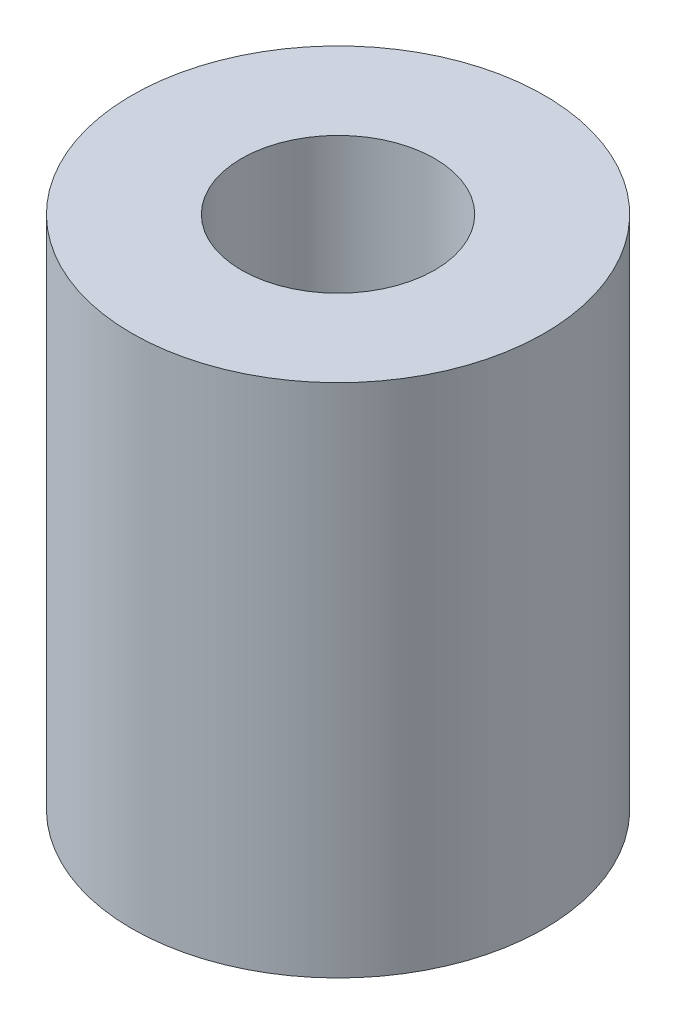
ISO-10303-21;
HEADER;
FILE_DESCRIPTION(('STEP AP214'),'2;1');
FILE_NAME('part.step','',(''),(''),'','','');
FILE_SCHEMA(('AUTOMOTIVE_DESIGN { 1 0 10303 214 1 1 1 1 }'));
ENDSEC;
DATA;
#1=APPLICATION_CONTEXT('core data for automotive mechanical design processes');
#2=APPLICATION_PROTOCOL_DEFINITION('international standard','automotive_design',2000,#1);
#3=PRODUCT_CONTEXT('',#1,'mechanical');
#4=PRODUCT('Part','Part','',(#3));
#5=PRODUCT_RELATED_PRODUCT_CATEGORY('part','',(#4));
#6=PRODUCT_DEFINITION_FORMATION('','',#4);
#7=PRODUCT_DEFINITION_CONTEXT('part definition',#1,'design');
#8=PRODUCT_DEFINITION('design','',#6,#7);
#9=PRODUCT_DEFINITION_SHAPE('','',#8);
#10=(LENGTH_UNIT() NAMED_UNIT(*) SI_UNIT(.MILLI.,.METRE.));
#11=(NAMED_UNIT(*) PLANE_ANGLE_UNIT() SI_UNIT($,.RADIAN.));
#12=(NAMED_UNIT(*) SI_UNIT($,.STERADIAN.) SOLID_ANGLE_UNIT());
#13=UNCERTAINTY_MEASURE_WITH_UNIT(LENGTH_MEASURE(1.E-05),#10,'distance_accuracy_value','');
#14=(GEOMETRIC_REPRESENTATION_CONTEXT(3) GLOBAL_UNCERTAINTY_ASSIGNED_CONTEXT((#13)) GLOBAL_UNIT_ASSIGNED_CONTEXT((#10,
#11,#12)) REPRESENTATION_CONTEXT('',''));
#15=CARTESIAN_POINT('',(0.,0.,0.));
#16=DIRECTION('',(0.,0.,1.));
#17=DIRECTION('',(1.,0.,0.));
#18=AXIS2_PLACEMENT_3D('',#15,#16,#17);
#19=CARTESIAN_POINT('',(0.,40.,0.));
#20=DIRECTION('',(0.,-1.,0.));
#21=DIRECTION('',(0.,0.,-1.));
#22=AXIS2_PLACEMENT_3D('',#19,#20,#21);
#23=CYLINDRICAL_SURFACE('',#22,7.);
#24=CARTESIAN_POINT('',(0.,0.,0.));
#25=DIRECTION('',(0.,1.,0.));
#26=DIRECTION('',(0.,0.,1.));
#27=AXIS2_PLACEMENT_3D('',#24,#25,#26);
#28=CIRCLE('',#27,7.);
#29=CARTESIAN_POINT('',(0.,0.,7.));
#30=VERTEX_POINT('',#29);
#31=EDGE_CURVE('E52',#30,#30,#28,.T.);
#32=ORIENTED_EDGE('',*,*,#31,.F.);
#33=EDGE_LOOP('',(#32));
#34=FACE_BOUND('',#33,.T.);
#35=CARTESIAN_POINT('',(0.,20.,0.));
#36=DIRECTION('',(0.,1.,0.));
#37=DIRECTION('',(0.,0.,1.));
#38=AXIS2_PLACEMENT_3D('',#35,#36,#37);
#39=CIRCLE('',#38,7.);
#40=CARTESIAN_POINT('',(0.,20.,7.));
#41=VERTEX_POINT('',#40);
#42=EDGE_CURVE('E41',#41,#41,#39,.T.);
#43=ORIENTED_EDGE('',*,*,#42,.T.);
#44=EDGE_LOOP('',(#43));
#45=FACE_BOUND('',#44,.T.);
#46=ADVANCED_FACE('F37',(#34,#45),#23,.F.);
#47=CARTESIAN_POINT('',(0.,40.,0.));
#48=DIRECTION('',(0.,1.,0.));
#49=DIRECTION('',(0.,0.,1.));
#50=AXIS2_PLACEMENT_3D('',#47,#48,#49);
#51=PLANE('',#50);
#52=CARTESIAN_POINT('',(0.,40.,0.));
#53=DIRECTION('',(0.,1.,0.));
#54=DIRECTION('',(0.,0.,1.));
#55=AXIS2_PLACEMENT_3D('',#52,#53,#54);
#56=CIRCLE('',#55,7.5);
#57=CARTESIAN_POINT('',(0.,40.,7.5));
#58=VERTEX_POINT('',#57);
#59=EDGE_CURVE('E57',#58,#58,#56,.T.);
#60=ORIENTED_EDGE('',*,*,#59,.F.);
#61=EDGE_LOOP('',(#60));
#62=FACE_BOUND('',#61,.T.);
#63=CARTESIAN_POINT('',(0.,40.,0.));
#64=DIRECTION('',(0.,1.,0.));
#65=DIRECTION('',(0.,0.,1.));
#66=AXIS2_PLACEMENT_3D('',#63,#64,#65);
#67=CIRCLE('',#66,16.);
#68=CARTESIAN_POINT('',(0.,40.,16.));
#69=VERTEX_POINT('',#68);
#70=EDGE_CURVE('E10',#69,#69,#67,.T.);
#71=ORIENTED_EDGE('',*,*,#70,.T.);
#72=EDGE_LOOP('',(#71));
#73=FACE_BOUND('',#72,.T.);
#74=ADVANCED_FACE('F81',(#62,#73),#51,.T.);
#75=CARTESIAN_POINT('',(0.,0.,0.));
#76=DIRECTION('',(0.,1.,0.));
#77=DIRECTION('',(0.,0.,1.));
#78=AXIS2_PLACEMENT_3D('',#75,#76,#77);
#79=PLANE('',#78);
#80=CARTESIAN_POINT('',(0.,0.,0.));
#81=DIRECTION('',(0.,1.,0.));
#82=DIRECTION('',(0.,0.,1.));
#83=AXIS2_PLACEMENT_3D('',#80,#81,#82);
#84=CIRCLE('',#83,16.);
#85=CARTESIAN_POINT('',(0.,0.,16.));
#86=VERTEX_POINT('',#85);
#87=EDGE_CURVE('E46',#86,#86,#84,.T.);
#88=ORIENTED_EDGE('',*,*,#87,.F.);
#89=EDGE_LOOP('',(#88));
#90=FACE_BOUND('',#89,.T.);
#91=ORIENTED_EDGE('',*,*,#31,.T.);
#92=EDGE_LOOP('',(#91));
#93=FACE_BOUND('',#92,.T.);
#94=ADVANCED_FACE('F87',(#90,#93),#79,.F.);
#95=CARTESIAN_POINT('',(0.,40.,0.));
#96=DIRECTION('',(0.,-1.,0.));
#97=DIRECTION('',(0.,0.,-1.));
#98=AXIS2_PLACEMENT_3D('',#95,#96,#97);
#99=CYLINDRICAL_SURFACE('',#98,16.);
#100=ORIENTED_EDGE('',*,*,#70,.F.);
#101=EDGE_LOOP('',(#100));
#102=FACE_BOUND('',#101,.T.);
#103=ORIENTED_EDGE('',*,*,#87,.T.);
#104=EDGE_LOOP('',(#103));
#105=FACE_BOUND('',#104,.T.);
#106=ADVANCED_FACE('F39',(#102,#105),#99,.T.);
#107=CARTESIAN_POINT('',(0.,20.,0.));
#108=DIRECTION('',(0.,1.,0.));
#109=DIRECTION('',(0.,0.,1.));
#110=AXIS2_PLACEMENT_3D('',#107,#108,#109);
#111=CYLINDRICAL_SURFACE('',#110,7.5);
#112=CARTESIAN_POINT('',(0.,20.,0.));
#113=DIRECTION('',(0.,1.,0.));
#114=DIRECTION('',(0.,0.,1.));
#115=AXIS2_PLACEMENT_3D('',#112,#113,#114);
#116=CIRCLE('',#115,7.5);
#117=CARTESIAN_POINT('',(0.,20.,7.5));
#118=VERTEX_POINT('',#117);
#119=EDGE_CURVE('E61',#118,#118,#116,.T.);
#120=ORIENTED_EDGE('',*,*,#119,.F.);
#121=EDGE_LOOP('',(#120));
#122=FACE_BOUND('',#121,.T.);
#123=ORIENTED_EDGE('',*,*,#59,.T.);
#124=EDGE_LOOP('',(#123));
#125=FACE_BOUND('',#124,.T.);
#126=ADVANCED_FACE('F73',(#122,#125),#111,.F.);
#127=CARTESIAN_POINT('',(0.,20.,0.));
#128=DIRECTION('',(0.,1.,0.));
#129=DIRECTION('',(0.,0.,1.));
#130=AXIS2_PLACEMENT_3D('',#127,#128,#129);
#131=PLANE('',#130);
#132=ORIENTED_EDGE('',*,*,#42,.F.);
#133=EDGE_LOOP('',(#132));
#134=FACE_BOUND('',#133,.T.);
#135=ORIENTED_EDGE('',*,*,#119,.T.);
#136=EDGE_LOOP('',(#135));
#137=FACE_BOUND('',#136,.T.);
#138=ADVANCED_FACE('F71',(#134,#137),#131,.T.);
#139=CLOSED_SHELL('',(#46,#74,#94,#106,#126,#138));
#140=MANIFOLD_SOLID_BREP('B2',#139);
#141=ADVANCED_BREP_SHAPE_REPRESENTATION('',(#18,#140),#14);
#142=SHAPE_DEFINITION_REPRESENTATION(#9,#141);
ENDSEC;
END-ISO-10303-21;
